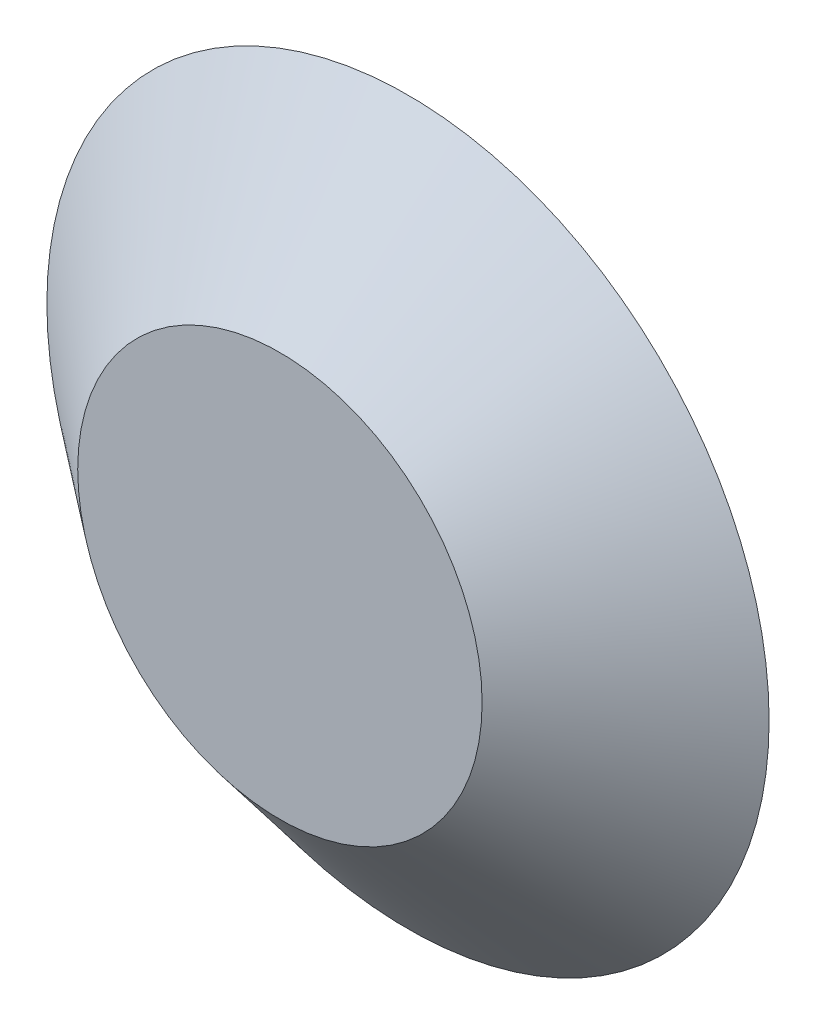
ISO-10303-21;
HEADER;
FILE_DESCRIPTION(('STEP AP214'),'2;1');
FILE_NAME('part.step','',(''),(''),'','','');
FILE_SCHEMA(('AUTOMOTIVE_DESIGN { 1 0 10303 214 1 1 1 1 }'));
ENDSEC;
DATA;
#1=APPLICATION_CONTEXT('core data for automotive mechanical design processes');
#2=APPLICATION_PROTOCOL_DEFINITION('international standard','automotive_design',2000,#1);
#3=PRODUCT_CONTEXT('',#1,'mechanical');
#4=PRODUCT('Part','Part','',(#3));
#5=PRODUCT_RELATED_PRODUCT_CATEGORY('part','',(#4));
#6=PRODUCT_DEFINITION_FORMATION('','',#4);
#7=PRODUCT_DEFINITION_CONTEXT('part definition',#1,'design');
#8=PRODUCT_DEFINITION('design','',#6,#7);
#9=PRODUCT_DEFINITION_SHAPE('','',#8);
#10=(LENGTH_UNIT() NAMED_UNIT(*) SI_UNIT(.MILLI.,.METRE.));
#11=(NAMED_UNIT(*) PLANE_ANGLE_UNIT() SI_UNIT($,.RADIAN.));
#12=(NAMED_UNIT(*) SI_UNIT($,.STERADIAN.) SOLID_ANGLE_UNIT());
#13=UNCERTAINTY_MEASURE_WITH_UNIT(LENGTH_MEASURE(1.E-05),#10,'distance_accuracy_value','');
#14=(GEOMETRIC_REPRESENTATION_CONTEXT(3) GLOBAL_UNCERTAINTY_ASSIGNED_CONTEXT((#13)) GLOBAL_UNIT_ASSIGNED_CONTEXT((#10,
#11,#12)) REPRESENTATION_CONTEXT('',''));
#15=CARTESIAN_POINT('',(0.,0.,0.));
#16=DIRECTION('',(0.,0.,1.));
#17=DIRECTION('',(1.,0.,0.));
#18=AXIS2_PLACEMENT_3D('',#15,#16,#17);
#19=CARTESIAN_POINT('',(0.,0.,0.));
#20=DIRECTION('',(0.,0.,-1.));
#21=DIRECTION('',(1.,0.,0.));
#22=AXIS2_PLACEMENT_3D('',#19,#20,#21);
#23=CONICAL_SURFACE('',#22,128.,0.892386846544703);
#24=CARTESIAN_POINT('',(0.,0.,45.4));
#25=DIRECTION('',(0.,0.,1.));
#26=DIRECTION('',(1.,0.,0.));
#27=AXIS2_PLACEMENT_3D('',#24,#25,#26);
#28=CIRCLE('',#27,71.6748422610552);
#29=CARTESIAN_POINT('',(71.6748422610552,0.,45.4));
#30=VERTEX_POINT('',#29);
#31=EDGE_CURVE('E10',#30,#30,#28,.T.);
#32=ORIENTED_EDGE('',*,*,#31,.F.);
#33=EDGE_LOOP('',(#32));
#34=FACE_BOUND('',#33,.T.);
#35=CARTESIAN_POINT('',(0.,0.,0.));
#36=DIRECTION('',(0.,0.,1.));
#37=DIRECTION('',(1.,0.,0.));
#38=AXIS2_PLACEMENT_3D('',#35,#36,#37);
#39=CIRCLE('',#38,128.);
#40=CARTESIAN_POINT('',(128.,0.,0.));
#41=VERTEX_POINT('',#40);
#42=EDGE_CURVE('E39',#41,#41,#39,.T.);
#43=ORIENTED_EDGE('',*,*,#42,.T.);
#44=EDGE_LOOP('',(#43));
#45=FACE_BOUND('',#44,.T.);
#46=ADVANCED_FACE('F33',(#34,#45),#23,.T.);
#47=CARTESIAN_POINT('',(0.,0.,45.4));
#48=DIRECTION('',(0.,0.,1.));
#49=DIRECTION('',(1.,0.,0.));
#50=AXIS2_PLACEMENT_3D('',#47,#48,#49);
#51=PLANE('',#50);
#52=ORIENTED_EDGE('',*,*,#31,.T.);
#53=EDGE_LOOP('',(#52));
#54=FACE_BOUND('',#53,.T.);
#55=ADVANCED_FACE('F48',(#54),#51,.T.);
#56=CARTESIAN_POINT('',(0.,0.,0.));
#57=DIRECTION('',(0.,0.,1.));
#58=DIRECTION('',(1.,0.,0.));
#59=AXIS2_PLACEMENT_3D('',#56,#57,#58);
#60=PLANE('',#59);
#61=ORIENTED_EDGE('',*,*,#42,.F.);
#62=EDGE_LOOP('',(#61));
#63=FACE_BOUND('',#62,.T.);
#64=ADVANCED_FACE('F46',(#63),#60,.F.);
#65=CLOSED_SHELL('',(#46,#55,#64));
#66=MANIFOLD_SOLID_BREP('B2',#65);
#67=ADVANCED_BREP_SHAPE_REPRESENTATION('',(#18,#66),#14);
#68=SHAPE_DEFINITION_REPRESENTATION(#9,#67);
ENDSEC;
END-ISO-10303-21;
